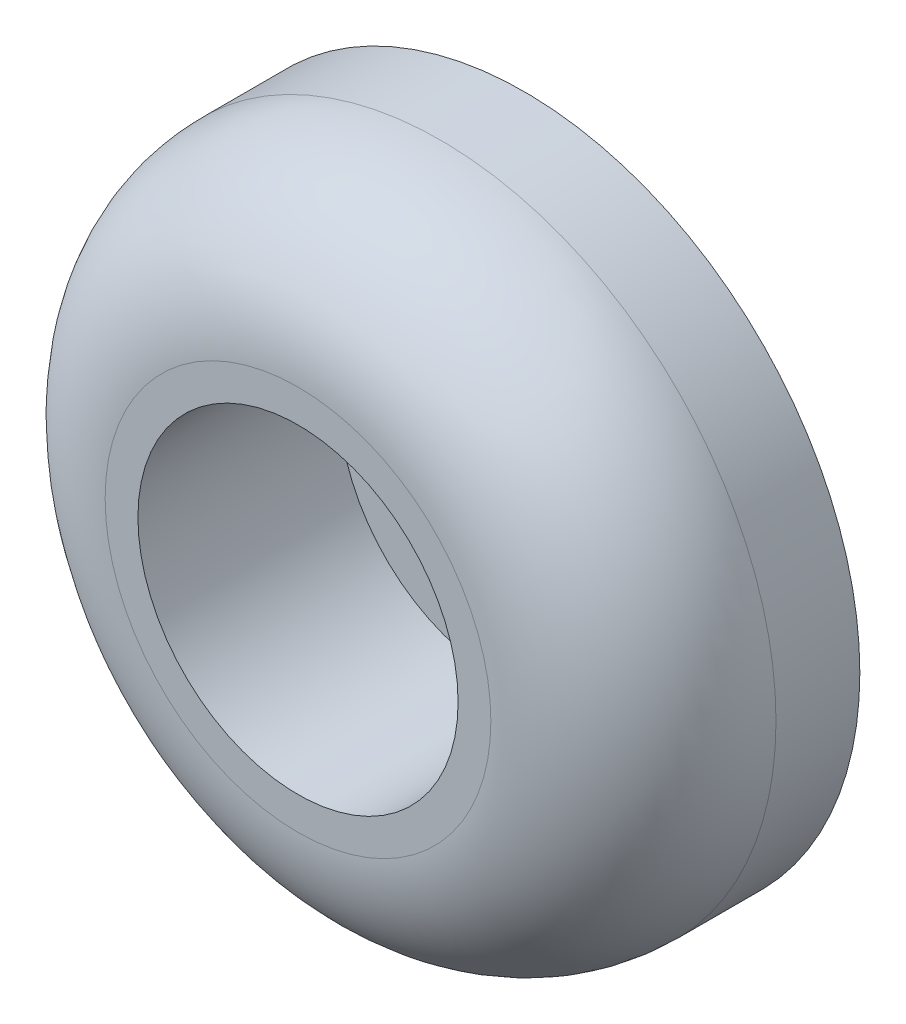
ISO-10303-21;
HEADER;
FILE_DESCRIPTION(('STEP AP214'),'2;1');
FILE_NAME('part.step','',(''),(''),'','','');
FILE_SCHEMA(('AUTOMOTIVE_DESIGN { 1 0 10303 214 1 1 1 1 }'));
ENDSEC;
DATA;
#1=APPLICATION_CONTEXT('core data for automotive mechanical design processes');
#2=APPLICATION_PROTOCOL_DEFINITION('international standard','automotive_design',2000,#1);
#3=PRODUCT_CONTEXT('',#1,'mechanical');
#4=PRODUCT('Part','Part','',(#3));
#5=PRODUCT_RELATED_PRODUCT_CATEGORY('part','',(#4));
#6=PRODUCT_DEFINITION_FORMATION('','',#4);
#7=PRODUCT_DEFINITION_CONTEXT('part definition',#1,'design');
#8=PRODUCT_DEFINITION('design','',#6,#7);
#9=PRODUCT_DEFINITION_SHAPE('','',#8);
#10=(LENGTH_UNIT() NAMED_UNIT(*) SI_UNIT(.MILLI.,.METRE.));
#11=(NAMED_UNIT(*) PLANE_ANGLE_UNIT() SI_UNIT($,.RADIAN.));
#12=(NAMED_UNIT(*) SI_UNIT($,.STERADIAN.) SOLID_ANGLE_UNIT());
#13=UNCERTAINTY_MEASURE_WITH_UNIT(LENGTH_MEASURE(1.E-05),#10,'distance_accuracy_value','');
#14=(GEOMETRIC_REPRESENTATION_CONTEXT(3) GLOBAL_UNCERTAINTY_ASSIGNED_CONTEXT((#13)) GLOBAL_UNIT_ASSIGNED_CONTEXT((#10,
#11,#12)) REPRESENTATION_CONTEXT('',''));
#15=CARTESIAN_POINT('',(0.,0.,0.));
#16=DIRECTION('',(0.,0.,1.));
#17=DIRECTION('',(1.,0.,0.));
#18=AXIS2_PLACEMENT_3D('',#15,#16,#17);
#19=CARTESIAN_POINT('',(0.,0.,0.750000000000001));
#20=DIRECTION('',(0.,0.,-1.));
#21=DIRECTION('',(-1.,0.,0.));
#22=AXIS2_PLACEMENT_3D('',#19,#20,#21);
#23=CYLINDRICAL_SURFACE('',#22,2.5);
#24=CARTESIAN_POINT('',(0.,0.,0.750000000000001));
#25=DIRECTION('',(0.,0.,-1.));
#26=DIRECTION('',(-1.,0.,0.));
#27=AXIS2_PLACEMENT_3D('',#24,#25,#26);
#28=CIRCLE('',#27,2.5);
#29=CARTESIAN_POINT('',(-2.5,0.,0.750000000000001));
#30=VERTEX_POINT('',#29);
#31=EDGE_CURVE('E127',#30,#30,#28,.T.);
#32=ORIENTED_EDGE('',*,*,#31,.F.);
#33=EDGE_LOOP('',(#32));
#34=FACE_BOUND('',#33,.T.);
#35=CARTESIAN_POINT('',(0.,0.,0.));
#36=DIRECTION('',(0.,0.,-1.));
#37=DIRECTION('',(-1.,0.,0.));
#38=AXIS2_PLACEMENT_3D('',#35,#36,#37);
#39=CIRCLE('',#38,2.5);
#40=CARTESIAN_POINT('',(-2.5,0.,0.));
#41=VERTEX_POINT('',#40);
#42=EDGE_CURVE('E132',#41,#41,#39,.T.);
#43=ORIENTED_EDGE('',*,*,#42,.T.);
#44=EDGE_LOOP('',(#43));
#45=FACE_BOUND('',#44,.T.);
#46=ADVANCED_FACE('F14',(#34,#45),#23,.F.);
#47=CARTESIAN_POINT('',(0.,0.,0.750000000000001));
#48=DIRECTION('',(0.,0.,1.));
#49=DIRECTION('',(1.,0.,0.));
#50=AXIS2_PLACEMENT_3D('',#47,#48,#49);
#51=PLANE('',#50);
#52=ORIENTED_EDGE('',*,*,#31,.T.);
#53=EDGE_LOOP('',(#52));
#54=FACE_BOUND('',#53,.T.);
#55=CARTESIAN_POINT('',(0.,0.,0.75));
#56=DIRECTION('',(0.,0.,-1.));
#57=DIRECTION('',(-1.,0.,0.));
#58=AXIS2_PLACEMENT_3D('',#55,#56,#57);
#59=CIRCLE('',#58,4.77285888461259);
#60=CARTESIAN_POINT('',(-4.77285888461259,0.,0.75));
#61=VERTEX_POINT('',#60);
#62=EDGE_CURVE('E130',#61,#61,#59,.F.);
#63=ORIENTED_EDGE('',*,*,#62,.T.);
#64=EDGE_LOOP('',(#63));
#65=FACE_BOUND('',#64,.T.);
#66=ADVANCED_FACE('F67',(#54,#65),#51,.T.);
#67=CARTESIAN_POINT('',(0.,0.,0.));
#68=DIRECTION('',(0.,0.,1.));
#69=DIRECTION('',(1.,0.,0.));
#70=AXIS2_PLACEMENT_3D('',#67,#68,#69);
#71=PLANE('',#70);
#72=ORIENTED_EDGE('',*,*,#42,.F.);
#73=EDGE_LOOP('',(#72));
#74=FACE_BOUND('',#73,.T.);
#75=CARTESIAN_POINT('',(0.,0.,0.));
#76=DIRECTION('',(0.,0.,1.));
#77=DIRECTION('',(1.,0.,0.));
#78=AXIS2_PLACEMENT_3D('',#75,#76,#77);
#79=CIRCLE('',#78,10.);
#80=CARTESIAN_POINT('',(10.,0.,0.));
#81=VERTEX_POINT('',#80);
#82=EDGE_CURVE('E31',#81,#81,#79,.T.);
#83=ORIENTED_EDGE('',*,*,#82,.F.);
#84=EDGE_LOOP('',(#83));
#85=FACE_BOUND('',#84,.T.);
#86=ADVANCED_FACE('F64',(#74,#85),#71,.F.);
#87=CARTESIAN_POINT('',(0.,0.,6.75));
#88=DIRECTION('',(0.,0.,-1.));
#89=DIRECTION('',(-1.,0.,0.));
#90=AXIS2_PLACEMENT_3D('',#87,#88,#89);
#91=CYLINDRICAL_SURFACE('',#90,4.77285888461259);
#92=CARTESIAN_POINT('',(0.,0.,6.75));
#93=DIRECTION('',(0.,0.,-1.));
#94=DIRECTION('',(-1.,0.,0.));
#95=AXIS2_PLACEMENT_3D('',#92,#93,#94);
#96=CIRCLE('',#95,4.77285888461259);
#97=CARTESIAN_POINT('',(-4.77285888461259,0.,6.75));
#98=VERTEX_POINT('',#97);
#99=EDGE_CURVE('E26',#98,#98,#96,.T.);
#100=ORIENTED_EDGE('',*,*,#99,.F.);
#101=EDGE_LOOP('',(#100));
#102=FACE_BOUND('',#101,.T.);
#103=ORIENTED_EDGE('',*,*,#62,.F.);
#104=EDGE_LOOP('',(#103));
#105=FACE_BOUND('',#104,.T.);
#106=ADVANCED_FACE('F60',(#102,#105),#91,.F.);
#107=CARTESIAN_POINT('',(0.,0.,0.));
#108=DIRECTION('',(0.,0.,1.));
#109=DIRECTION('',(1.,0.,0.));
#110=AXIS2_PLACEMENT_3D('',#107,#108,#109);
#111=CYLINDRICAL_SURFACE('',#110,10.);
#112=CARTESIAN_POINT('',(0.,0.,2.5));
#113=DIRECTION('',(0.,0.,1.));
#114=DIRECTION('',(1.,0.,0.));
#115=AXIS2_PLACEMENT_3D('',#112,#113,#114);
#116=CIRCLE('',#115,10.);
#117=CARTESIAN_POINT('',(10.,0.,2.5));
#118=VERTEX_POINT('',#117);
#119=EDGE_CURVE('E21',#118,#118,#116,.T.);
#120=ORIENTED_EDGE('',*,*,#119,.F.);
#121=EDGE_LOOP('',(#120));
#122=FACE_BOUND('',#121,.T.);
#123=ORIENTED_EDGE('',*,*,#82,.T.);
#124=EDGE_LOOP('',(#123));
#125=FACE_BOUND('',#124,.T.);
#126=ADVANCED_FACE('F55',(#122,#125),#111,.T.);
#127=CARTESIAN_POINT('',(0.,0.,6.75));
#128=DIRECTION('',(0.,0.,1.));
#129=DIRECTION('',(1.,0.,0.));
#130=AXIS2_PLACEMENT_3D('',#127,#128,#129);
#131=PLANE('',#130);
#132=ORIENTED_EDGE('',*,*,#99,.T.);
#133=EDGE_LOOP('',(#132));
#134=FACE_BOUND('',#133,.T.);
#135=CARTESIAN_POINT('',(0.,0.,6.75));
#136=DIRECTION('',(0.,0.,-1.));
#137=DIRECTION('',(1.,0.,0.));
#138=AXIS2_PLACEMENT_3D('',#135,#136,#137);
#139=CIRCLE('',#138,5.75);
#140=CARTESIAN_POINT('',(5.75,0.,6.75));
#141=VERTEX_POINT('',#140);
#142=EDGE_CURVE('E10',#141,#141,#139,.T.);
#143=ORIENTED_EDGE('',*,*,#142,.F.);
#144=EDGE_LOOP('',(#143));
#145=FACE_BOUND('',#144,.T.);
#146=ADVANCED_FACE('F44',(#134,#145),#131,.T.);
#147=CARTESIAN_POINT('',(0.,0.,2.5));
#148=DIRECTION('',(0.,0.,1.));
#149=DIRECTION('',(1.,0.,0.));
#150=AXIS2_PLACEMENT_3D('',#147,#148,#149);
#151=TOROIDAL_SURFACE('',#150,5.75,4.25);
#152=ORIENTED_EDGE('',*,*,#142,.T.);
#153=EDGE_LOOP('',(#152));
#154=FACE_BOUND('',#153,.T.);
#155=ORIENTED_EDGE('',*,*,#119,.T.);
#156=EDGE_LOOP('',(#155));
#157=FACE_BOUND('',#156,.T.);
#158=ADVANCED_FACE('F54',(#154,#157),#151,.T.);
#159=CLOSED_SHELL('',(#46,#66,#86,#106,#126,#146,#158));
#160=MANIFOLD_SOLID_BREP('B1',#159);
#161=ADVANCED_BREP_SHAPE_REPRESENTATION('',(#18,#160),#14);
#162=SHAPE_DEFINITION_REPRESENTATION(#9,#161);
ENDSEC;
END-ISO-10303-21;
